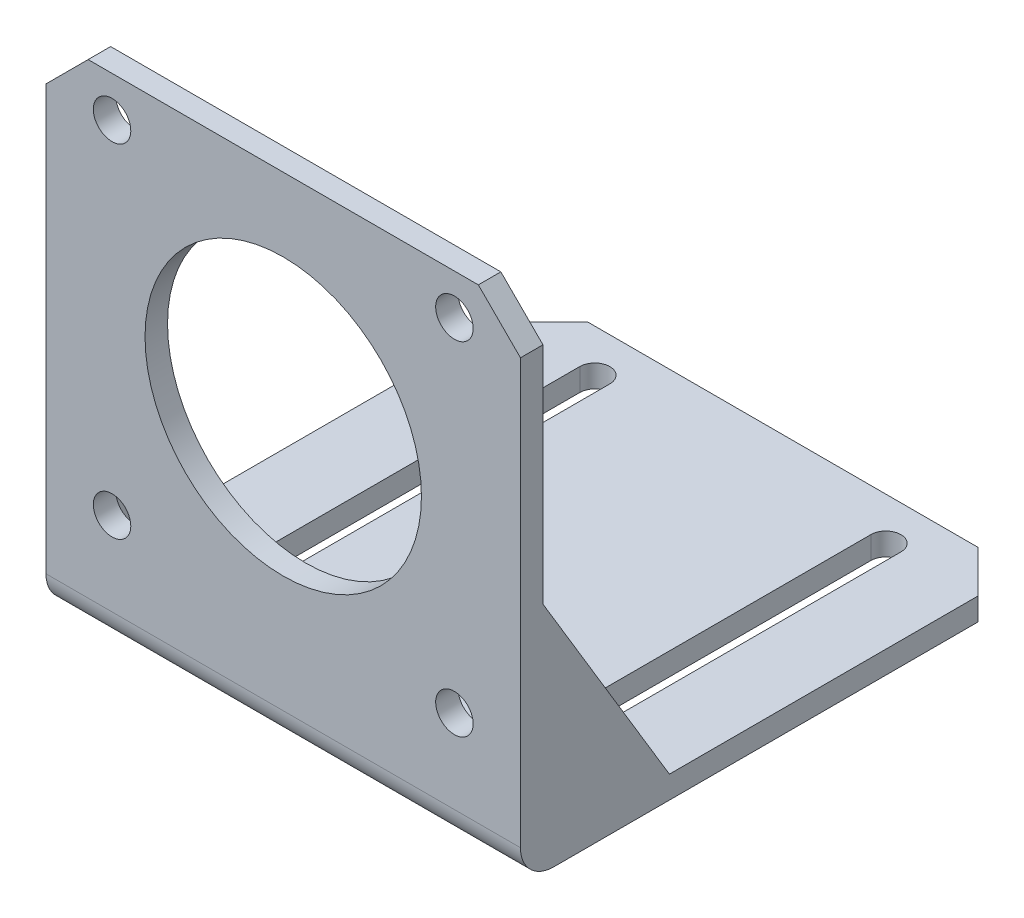
ISO-10303-21;
HEADER;
FILE_DESCRIPTION(('STEP AP214'),'2;1');
FILE_NAME('part.step','',(''),(''),'','','');
FILE_SCHEMA(('AUTOMOTIVE_DESIGN { 1 0 10303 214 1 1 1 1 }'));
ENDSEC;
DATA;
#1=APPLICATION_CONTEXT('core data for automotive mechanical design processes');
#2=APPLICATION_PROTOCOL_DEFINITION('international standard','automotive_design',2000,#1);
#3=PRODUCT_CONTEXT('',#1,'mechanical');
#4=PRODUCT('Part','Part','',(#3));
#5=PRODUCT_RELATED_PRODUCT_CATEGORY('part','',(#4));
#6=PRODUCT_DEFINITION_FORMATION('','',#4);
#7=PRODUCT_DEFINITION_CONTEXT('part definition',#1,'design');
#8=PRODUCT_DEFINITION('design','',#6,#7);
#9=PRODUCT_DEFINITION_SHAPE('','',#8);
#10=(LENGTH_UNIT() NAMED_UNIT(*) SI_UNIT(.MILLI.,.METRE.));
#11=(NAMED_UNIT(*) PLANE_ANGLE_UNIT() SI_UNIT($,.RADIAN.));
#12=(NAMED_UNIT(*) SI_UNIT($,.STERADIAN.) SOLID_ANGLE_UNIT());
#13=UNCERTAINTY_MEASURE_WITH_UNIT(LENGTH_MEASURE(1.E-05),#10,'distance_accuracy_value','');
#14=(GEOMETRIC_REPRESENTATION_CONTEXT(3) GLOBAL_UNCERTAINTY_ASSIGNED_CONTEXT((#13)) GLOBAL_UNIT_ASSIGNED_CONTEXT((#10,
#11,#12)) REPRESENTATION_CONTEXT('',''));
#15=CARTESIAN_POINT('',(0.,0.,0.));
#16=DIRECTION('',(0.,0.,1.));
#17=DIRECTION('',(1.,0.,0.));
#18=AXIS2_PLACEMENT_3D('',#15,#16,#17);
#19=CARTESIAN_POINT('',(65.33,0.,-1.48));
#20=DIRECTION('',(-1.,0.,0.));
#21=DIRECTION('',(0.,0.,1.));
#22=AXIS2_PLACEMENT_3D('',#19,#20,#21);
#23=CYLINDRICAL_SURFACE('',#22,1.48);
#24=DIRECTION('',(-1.,0.,0.));
#25=VECTOR('',#24,1.);
#26=CARTESIAN_POINT('',(65.33,-1.48,-1.47999999999999));
#27=LINE('',#26,#25);
#28=CARTESIAN_POINT('',(62.81,-1.48,-1.48));
#29=VERTEX_POINT('',#28);
#30=CARTESIAN_POINT('',(2.51999999999999,-1.48,-1.47999999999999));
#31=VERTEX_POINT('',#30);
#32=EDGE_CURVE('E327',#29,#31,#27,.T.);
#33=ORIENTED_EDGE('',*,*,#32,.T.);
#34=CARTESIAN_POINT('',(2.51999999999999,0.,-1.48));
#35=DIRECTION('',(1.,0.,0.));
#36=DIRECTION('',(0.,0.,-1.));
#37=AXIS2_PLACEMENT_3D('',#34,#35,#36);
#38=CIRCLE('',#37,1.48);
#39=CARTESIAN_POINT('',(2.51999999999999,0.,0.));
#40=VERTEX_POINT('',#39);
#41=EDGE_CURVE('E291',#31,#40,#38,.F.);
#42=ORIENTED_EDGE('',*,*,#41,.T.);
#43=DIRECTION('',(-1.,0.,0.));
#44=VECTOR('',#43,1.);
#45=CARTESIAN_POINT('',(65.33,0.,0.));
#46=LINE('',#45,#44);
#47=CARTESIAN_POINT('',(62.81,0.,0.));
#48=VERTEX_POINT('',#47);
#49=EDGE_CURVE('E357',#48,#40,#46,.T.);
#50=ORIENTED_EDGE('',*,*,#49,.F.);
#51=CARTESIAN_POINT('',(62.81,0.,-1.48));
#52=DIRECTION('',(1.,0.,0.));
#53=DIRECTION('',(0.,0.,-1.));
#54=AXIS2_PLACEMENT_3D('',#51,#52,#53);
#55=CIRCLE('',#54,1.48);
#56=EDGE_CURVE('E309',#29,#48,#55,.F.);
#57=ORIENTED_EDGE('',*,*,#56,.F.);
#58=EDGE_LOOP('',(#33,#42,#50,#57));
#59=FACE_BOUND('',#58,.T.);
#60=ADVANCED_FACE('F34',(#59),#23,.F.);
#61=CARTESIAN_POINT('',(65.33,0.,0.));
#62=DIRECTION('',(0.,0.,1.));
#63=DIRECTION('',(0.,-1.,0.));
#64=AXIS2_PLACEMENT_3D('',#61,#62,#63);
#65=PLANE('',#64);
#66=CARTESIAN_POINT('',(56.235,11.52,0.));
#67=DIRECTION('',(0.,0.,-1.));
#68=DIRECTION('',(0.,1.,0.));
#69=AXIS2_PLACEMENT_3D('',#66,#67,#68);
#70=CIRCLE('',#69,2.58);
#71=CARTESIAN_POINT('',(56.235,14.1,0.));
#72=VERTEX_POINT('',#71);
#73=EDGE_CURVE('E227',#72,#72,#70,.T.);
#74=ORIENTED_EDGE('',*,*,#73,.F.);
#75=EDGE_LOOP('',(#74));
#76=FACE_BOUND('',#75,.T.);
#77=CARTESIAN_POINT('',(9.095,11.52,0.));
#78=DIRECTION('',(0.,0.,-1.));
#79=DIRECTION('',(0.,1.,0.));
#80=AXIS2_PLACEMENT_3D('',#77,#78,#79);
#81=CIRCLE('',#80,2.58);
#82=CARTESIAN_POINT('',(9.095,14.1,0.));
#83=VERTEX_POINT('',#82);
#84=EDGE_CURVE('E264',#83,#83,#81,.T.);
#85=ORIENTED_EDGE('',*,*,#84,.F.);
#86=EDGE_LOOP('',(#85));
#87=FACE_BOUND('',#86,.T.);
#88=CARTESIAN_POINT('',(56.235,58.66,0.));
#89=DIRECTION('',(0.,0.,-1.));
#90=DIRECTION('',(0.,1.,0.));
#91=AXIS2_PLACEMENT_3D('',#88,#89,#90);
#92=CIRCLE('',#91,2.58);
#93=CARTESIAN_POINT('',(56.235,61.24,0.));
#94=VERTEX_POINT('',#93);
#95=EDGE_CURVE('E258',#94,#94,#92,.T.);
#96=ORIENTED_EDGE('',*,*,#95,.F.);
#97=EDGE_LOOP('',(#96));
#98=FACE_BOUND('',#97,.T.);
#99=CARTESIAN_POINT('',(9.095,58.66,0.));
#100=DIRECTION('',(0.,0.,-1.));
#101=DIRECTION('',(0.,1.,0.));
#102=AXIS2_PLACEMENT_3D('',#99,#100,#101);
#103=CIRCLE('',#102,2.58);
#104=CARTESIAN_POINT('',(9.095,61.24,0.));
#105=VERTEX_POINT('',#104);
#106=EDGE_CURVE('E252',#105,#105,#103,.T.);
#107=ORIENTED_EDGE('',*,*,#106,.F.);
#108=EDGE_LOOP('',(#107));
#109=FACE_BOUND('',#108,.T.);
#110=CARTESIAN_POINT('',(32.665,35.09,0.));
#111=DIRECTION('',(0.,0.,-1.));
#112=DIRECTION('',(0.,1.,0.));
#113=AXIS2_PLACEMENT_3D('',#110,#111,#112);
#114=CIRCLE('',#113,19.03);
#115=CARTESIAN_POINT('',(32.665,54.12,0.));
#116=VERTEX_POINT('',#115);
#117=EDGE_CURVE('E251',#116,#116,#114,.T.);
#118=ORIENTED_EDGE('',*,*,#117,.F.);
#119=EDGE_LOOP('',(#118));
#120=FACE_BOUND('',#119,.T.);
#121=DIRECTION('',(0.,1.,0.));
#122=VECTOR('',#121,1.);
#123=CARTESIAN_POINT('',(2.52,-1.48,0.));
#124=LINE('',#123,#122);
#125=CARTESIAN_POINT('',(2.51999999999999,27.49,0.));
#126=VERTEX_POINT('',#125);
#127=EDGE_CURVE('E278',#40,#126,#124,.T.);
#128=ORIENTED_EDGE('',*,*,#127,.T.);
#129=DIRECTION('',(-1.,0.,0.));
#130=VECTOR('',#129,1.);
#131=CARTESIAN_POINT('',(2.52,27.49,0.));
#132=LINE('',#131,#130);
#133=CARTESIAN_POINT('',(0.,27.49,0.));
#134=VERTEX_POINT('',#133);
#135=EDGE_CURVE('E285',#126,#134,#132,.T.);
#136=ORIENTED_EDGE('',*,*,#135,.T.);
#137=DIRECTION('',(0.,1.,0.));
#138=VECTOR('',#137,1.);
#139=CARTESIAN_POINT('',(0.,0.,0.));
#140=LINE('',#139,#138);
#141=CARTESIAN_POINT('',(0.,58.42,0.));
#142=VERTEX_POINT('',#141);
#143=EDGE_CURVE('E313',#134,#142,#140,.T.);
#144=ORIENTED_EDGE('',*,*,#143,.T.);
#145=DIRECTION('',(-0.707106781186546,-0.707106781186549,0.));
#146=VECTOR('',#145,1.);
#147=CARTESIAN_POINT('',(5.8,64.22,0.));
#148=LINE('',#147,#146);
#149=CARTESIAN_POINT('',(5.8,64.22,0.));
#150=VERTEX_POINT('',#149);
#151=EDGE_CURVE('E377',#142,#150,#148,.F.);
#152=ORIENTED_EDGE('',*,*,#151,.T.);
#153=DIRECTION('',(-1.,0.,0.));
#154=VECTOR('',#153,1.);
#155=CARTESIAN_POINT('',(65.33,64.22,0.));
#156=LINE('',#155,#154);
#157=CARTESIAN_POINT('',(59.53,64.22,0.));
#158=VERTEX_POINT('',#157);
#159=EDGE_CURVE('E354',#158,#150,#156,.T.);
#160=ORIENTED_EDGE('',*,*,#159,.F.);
#161=DIRECTION('',(0.707106781186548,-0.707106781186548,0.));
#162=VECTOR('',#161,1.);
#163=CARTESIAN_POINT('',(65.33,58.42,0.));
#164=LINE('',#163,#162);
#165=CARTESIAN_POINT('',(65.33,58.42,0.));
#166=VERTEX_POINT('',#165);
#167=EDGE_CURVE('E374',#158,#166,#164,.T.);
#168=ORIENTED_EDGE('',*,*,#167,.T.);
#169=DIRECTION('',(0.,1.,0.));
#170=VECTOR('',#169,1.);
#171=CARTESIAN_POINT('',(65.33,0.,0.));
#172=LINE('',#171,#170);
#173=CARTESIAN_POINT('',(65.33,27.49,0.));
#174=VERTEX_POINT('',#173);
#175=EDGE_CURVE('E314',#174,#166,#172,.T.);
#176=ORIENTED_EDGE('',*,*,#175,.F.);
#177=DIRECTION('',(1.,0.,0.));
#178=VECTOR('',#177,1.);
#179=CARTESIAN_POINT('',(62.81,27.49,0.));
#180=LINE('',#179,#178);
#181=CARTESIAN_POINT('',(62.81,27.49,0.));
#182=VERTEX_POINT('',#181);
#183=EDGE_CURVE('E307',#182,#174,#180,.T.);
#184=ORIENTED_EDGE('',*,*,#183,.F.);
#185=DIRECTION('',(0.,-1.,0.));
#186=VECTOR('',#185,1.);
#187=CARTESIAN_POINT('',(62.81,-1.48,0.));
#188=LINE('',#187,#186);
#189=EDGE_CURVE('E295',#182,#48,#188,.T.);
#190=ORIENTED_EDGE('',*,*,#189,.T.);
#191=ORIENTED_EDGE('',*,*,#49,.T.);
#192=EDGE_LOOP('',(#128,#136,#144,#152,#160,#168,#176,#184,#190,#191));
#193=FACE_BOUND('',#192,.T.);
#194=ADVANCED_FACE('F430',(#76,#87,#98,#109,#120,#193),#65,.F.);
#195=CARTESIAN_POINT('',(65.33,64.22,0.));
#196=DIRECTION('',(0.,-1.,0.));
#197=DIRECTION('',(0.,0.,-1.));
#198=AXIS2_PLACEMENT_3D('',#195,#196,#197);
#199=PLANE('',#198);
#200=ORIENTED_EDGE('',*,*,#159,.T.);
#201=DIRECTION('',(0.,0.,1.));
#202=VECTOR('',#201,1.);
#203=CARTESIAN_POINT('',(5.8,64.22,0.));
#204=LINE('',#203,#202);
#205=CARTESIAN_POINT('',(5.8,64.22,3.10000000000001));
#206=VERTEX_POINT('',#205);
#207=EDGE_CURVE('E362',#150,#206,#204,.T.);
#208=ORIENTED_EDGE('',*,*,#207,.T.);
#209=DIRECTION('',(-1.,0.,0.));
#210=VECTOR('',#209,1.);
#211=CARTESIAN_POINT('',(65.33,64.22,3.10000000000001));
#212=LINE('',#211,#210);
#213=CARTESIAN_POINT('',(59.53,64.22,3.10000000000001));
#214=VERTEX_POINT('',#213);
#215=EDGE_CURVE('E351',#214,#206,#212,.T.);
#216=ORIENTED_EDGE('',*,*,#215,.F.);
#217=DIRECTION('',(0.,0.,-1.));
#218=VECTOR('',#217,1.);
#219=CARTESIAN_POINT('',(59.53,64.22,0.));
#220=LINE('',#219,#218);
#221=EDGE_CURVE('E360',#214,#158,#220,.T.);
#222=ORIENTED_EDGE('',*,*,#221,.T.);
#223=EDGE_LOOP('',(#200,#208,#216,#222));
#224=FACE_BOUND('',#223,.T.);
#225=ADVANCED_FACE('F436',(#224),#199,.F.);
#226=CARTESIAN_POINT('',(65.33,0.,3.10000000000001));
#227=DIRECTION('',(0.,0.,-1.));
#228=DIRECTION('',(-1.,0.,0.));
#229=AXIS2_PLACEMENT_3D('',#226,#227,#228);
#230=PLANE('',#229);
#231=CARTESIAN_POINT('',(56.235,11.52,3.10000000000001));
#232=DIRECTION('',(0.,0.,-1.));
#233=DIRECTION('',(0.,1.,0.));
#234=AXIS2_PLACEMENT_3D('',#231,#232,#233);
#235=CIRCLE('',#234,2.58);
#236=CARTESIAN_POINT('',(56.235,14.1,3.10000000000001));
#237=VERTEX_POINT('',#236);
#238=EDGE_CURVE('E267',#237,#237,#235,.T.);
#239=ORIENTED_EDGE('',*,*,#238,.T.);
#240=EDGE_LOOP('',(#239));
#241=FACE_BOUND('',#240,.T.);
#242=CARTESIAN_POINT('',(9.095,11.52,3.10000000000001));
#243=DIRECTION('',(0.,0.,-1.));
#244=DIRECTION('',(0.,1.,0.));
#245=AXIS2_PLACEMENT_3D('',#242,#243,#244);
#246=CIRCLE('',#245,2.58);
#247=CARTESIAN_POINT('',(9.095,14.1,3.10000000000001));
#248=VERTEX_POINT('',#247);
#249=EDGE_CURVE('E261',#248,#248,#246,.T.);
#250=ORIENTED_EDGE('',*,*,#249,.T.);
#251=EDGE_LOOP('',(#250));
#252=FACE_BOUND('',#251,.T.);
#253=CARTESIAN_POINT('',(56.235,58.66,3.10000000000001));
#254=DIRECTION('',(0.,0.,-1.));
#255=DIRECTION('',(0.,1.,0.));
#256=AXIS2_PLACEMENT_3D('',#253,#254,#255);
#257=CIRCLE('',#256,2.58);
#258=CARTESIAN_POINT('',(56.235,61.24,3.10000000000001));
#259=VERTEX_POINT('',#258);
#260=EDGE_CURVE('E255',#259,#259,#257,.T.);
#261=ORIENTED_EDGE('',*,*,#260,.T.);
#262=EDGE_LOOP('',(#261));
#263=FACE_BOUND('',#262,.T.);
#264=CARTESIAN_POINT('',(9.095,58.66,3.10000000000001));
#265=DIRECTION('',(0.,0.,-1.));
#266=DIRECTION('',(0.,1.,0.));
#267=AXIS2_PLACEMENT_3D('',#264,#265,#266);
#268=CIRCLE('',#267,2.58);
#269=CARTESIAN_POINT('',(9.095,61.24,3.10000000000001));
#270=VERTEX_POINT('',#269);
#271=EDGE_CURVE('E248',#270,#270,#268,.T.);
#272=ORIENTED_EDGE('',*,*,#271,.T.);
#273=EDGE_LOOP('',(#272));
#274=FACE_BOUND('',#273,.T.);
#275=CARTESIAN_POINT('',(32.665,35.09,3.10000000000001));
#276=DIRECTION('',(0.,0.,-1.));
#277=DIRECTION('',(0.,1.,0.));
#278=AXIS2_PLACEMENT_3D('',#275,#276,#277);
#279=CIRCLE('',#278,19.03);
#280=CARTESIAN_POINT('',(32.665,54.12,3.10000000000001));
#281=VERTEX_POINT('',#280);
#282=EDGE_CURVE('E272',#281,#281,#279,.T.);
#283=ORIENTED_EDGE('',*,*,#282,.T.);
#284=EDGE_LOOP('',(#283));
#285=FACE_BOUND('',#284,.T.);
#286=ORIENTED_EDGE('',*,*,#215,.T.);
#287=DIRECTION('',(0.707106781186546,0.707106781186549,0.));
#288=VECTOR('',#287,1.);
#289=CARTESIAN_POINT('',(5.8,64.22,3.10000000000001));
#290=LINE('',#289,#288);
#291=CARTESIAN_POINT('',(0.,58.42,3.10000000000001));
#292=VERTEX_POINT('',#291);
#293=EDGE_CURVE('E367',#206,#292,#290,.F.);
#294=ORIENTED_EDGE('',*,*,#293,.T.);
#295=DIRECTION('',(0.,-1.,0.));
#296=VECTOR('',#295,1.);
#297=CARTESIAN_POINT('',(0.,0.,3.10000000000001));
#298=LINE('',#297,#296);
#299=CARTESIAN_POINT('',(0.,0.,3.10000000000001));
#300=VERTEX_POINT('',#299);
#301=EDGE_CURVE('E329',#292,#300,#298,.T.);
#302=ORIENTED_EDGE('',*,*,#301,.T.);
#303=DIRECTION('',(-1.,0.,0.));
#304=VECTOR('',#303,1.);
#305=CARTESIAN_POINT('',(65.33,0.,3.10000000000001));
#306=LINE('',#305,#304);
#307=CARTESIAN_POINT('',(65.33,0.,3.10000000000001));
#308=VERTEX_POINT('',#307);
#309=EDGE_CURVE('E348',#308,#300,#306,.T.);
#310=ORIENTED_EDGE('',*,*,#309,.F.);
#311=DIRECTION('',(0.,-1.,0.));
#312=VECTOR('',#311,1.);
#313=CARTESIAN_POINT('',(65.33,0.,3.10000000000001));
#314=LINE('',#313,#312);
#315=CARTESIAN_POINT('',(65.33,58.42,3.10000000000001));
#316=VERTEX_POINT('',#315);
#317=EDGE_CURVE('E316',#316,#308,#314,.T.);
#318=ORIENTED_EDGE('',*,*,#317,.F.);
#319=DIRECTION('',(-0.707106781186548,0.707106781186548,0.));
#320=VECTOR('',#319,1.);
#321=CARTESIAN_POINT('',(65.33,58.42,3.10000000000001));
#322=LINE('',#321,#320);
#323=EDGE_CURVE('E365',#316,#214,#322,.T.);
#324=ORIENTED_EDGE('',*,*,#323,.T.);
#325=EDGE_LOOP('',(#286,#294,#302,#310,#318,#324));
#326=FACE_BOUND('',#325,.T.);
#327=ADVANCED_FACE('F511',(#241,#252,#263,#274,#285,#326),#230,.F.);
#328=CARTESIAN_POINT('',(65.33,0.,-1.48));
#329=DIRECTION('',(-1.,0.,0.));
#330=DIRECTION('',(0.,0.,1.));
#331=AXIS2_PLACEMENT_3D('',#328,#329,#330);
#332=CYLINDRICAL_SURFACE('',#331,4.58);
#333=CARTESIAN_POINT('',(0.,0.,-1.48));
#334=DIRECTION('',(1.,0.,0.));
#335=DIRECTION('',(0.,0.,-1.));
#336=AXIS2_PLACEMENT_3D('',#333,#334,#335);
#337=CIRCLE('',#336,4.58);
#338=CARTESIAN_POINT('',(0.,-4.58,-1.47999999999999));
#339=VERTEX_POINT('',#338);
#340=EDGE_CURVE('E331',#300,#339,#337,.T.);
#341=ORIENTED_EDGE('',*,*,#340,.T.);
#342=DIRECTION('',(-1.,0.,0.));
#343=VECTOR('',#342,1.);
#344=CARTESIAN_POINT('',(65.33,-4.58,-1.47999999999999));
#345=LINE('',#344,#343);
#346=CARTESIAN_POINT('',(65.33,-4.58,-1.47999999999999));
#347=VERTEX_POINT('',#346);
#348=EDGE_CURVE('E345',#347,#339,#345,.T.);
#349=ORIENTED_EDGE('',*,*,#348,.F.);
#350=CARTESIAN_POINT('',(65.33,0.,-1.48));
#351=DIRECTION('',(1.,0.,0.));
#352=DIRECTION('',(0.,0.,-1.));
#353=AXIS2_PLACEMENT_3D('',#350,#351,#352);
#354=CIRCLE('',#353,4.58);
#355=EDGE_CURVE('E319',#308,#347,#354,.T.);
#356=ORIENTED_EDGE('',*,*,#355,.F.);
#357=ORIENTED_EDGE('',*,*,#309,.T.);
#358=EDGE_LOOP('',(#341,#349,#356,#357));
#359=FACE_BOUND('',#358,.T.);
#360=ADVANCED_FACE('F478',(#359),#332,.T.);
#361=CARTESIAN_POINT('',(65.33,-4.58,-1.47999999999999));
#362=DIRECTION('',(0.,1.,0.));
#363=DIRECTION('',(0.,0.,1.));
#364=AXIS2_PLACEMENT_3D('',#361,#362,#363);
#365=PLANE('',#364);
#366=DIRECTION('',(0.,0.,1.));
#367=VECTOR('',#366,1.);
#368=CARTESIAN_POINT('',(50.635,-4.58,-9.66999999999999));
#369=LINE('',#368,#367);
#370=CARTESIAN_POINT('',(50.635,-4.58,-59.84));
#371=VERTEX_POINT('',#370);
#372=CARTESIAN_POINT('',(50.635,-4.58,-9.66999999999999));
#373=VERTEX_POINT('',#372);
#374=EDGE_CURVE('E207',#371,#373,#369,.T.);
#375=ORIENTED_EDGE('',*,*,#374,.T.);
#376=CARTESIAN_POINT('',(52.705,-4.58,-9.66999999999999));
#377=DIRECTION('',(0.,1.,0.));
#378=DIRECTION('',(0.,0.,1.));
#379=AXIS2_PLACEMENT_3D('',#376,#377,#378);
#380=CIRCLE('',#379,2.07);
#381=CARTESIAN_POINT('',(54.775,-4.58,-9.66999999999999));
#382=VERTEX_POINT('',#381);
#383=EDGE_CURVE('E202',#373,#382,#380,.T.);
#384=ORIENTED_EDGE('',*,*,#383,.T.);
#385=DIRECTION('',(0.,0.,-1.));
#386=VECTOR('',#385,1.);
#387=CARTESIAN_POINT('',(54.775,-4.58,-9.66999999999999));
#388=LINE('',#387,#386);
#389=CARTESIAN_POINT('',(54.775,-4.58,-59.84));
#390=VERTEX_POINT('',#389);
#391=EDGE_CURVE('E210',#382,#390,#388,.T.);
#392=ORIENTED_EDGE('',*,*,#391,.T.);
#393=CARTESIAN_POINT('',(52.705,-4.58,-59.84));
#394=DIRECTION('',(0.,1.,0.));
#395=DIRECTION('',(0.,0.,1.));
#396=AXIS2_PLACEMENT_3D('',#393,#394,#395);
#397=CIRCLE('',#396,2.07);
#398=EDGE_CURVE('E49',#390,#371,#397,.T.);
#399=ORIENTED_EDGE('',*,*,#398,.T.);
#400=EDGE_LOOP('',(#375,#384,#392,#399));
#401=FACE_BOUND('',#400,.T.);
#402=DIRECTION('',(0.,0.,1.));
#403=VECTOR('',#402,1.);
#404=CARTESIAN_POINT('',(10.555,-4.58,-9.66999999999999));
#405=LINE('',#404,#403);
#406=CARTESIAN_POINT('',(10.555,-4.58,-59.84));
#407=VERTEX_POINT('',#406);
#408=CARTESIAN_POINT('',(10.555,-4.58,-9.66999999999999));
#409=VERTEX_POINT('',#408);
#410=EDGE_CURVE('E239',#407,#409,#405,.T.);
#411=ORIENTED_EDGE('',*,*,#410,.T.);
#412=CARTESIAN_POINT('',(12.625,-4.58,-9.66999999999999));
#413=DIRECTION('',(0.,1.,0.));
#414=DIRECTION('',(0.,0.,1.));
#415=AXIS2_PLACEMENT_3D('',#412,#413,#414);
#416=CIRCLE('',#415,2.07);
#417=CARTESIAN_POINT('',(14.695,-4.58,-9.66999999999999));
#418=VERTEX_POINT('',#417);
#419=EDGE_CURVE('E232',#409,#418,#416,.T.);
#420=ORIENTED_EDGE('',*,*,#419,.T.);
#421=DIRECTION('',(0.,0.,-1.));
#422=VECTOR('',#421,1.);
#423=CARTESIAN_POINT('',(14.695,-4.58,-9.66999999999999));
#424=LINE('',#423,#422);
#425=CARTESIAN_POINT('',(14.695,-4.58,-59.84));
#426=VERTEX_POINT('',#425);
#427=EDGE_CURVE('E235',#418,#426,#424,.T.);
#428=ORIENTED_EDGE('',*,*,#427,.T.);
#429=CARTESIAN_POINT('',(12.625,-4.58,-59.84));
#430=DIRECTION('',(0.,1.,0.));
#431=DIRECTION('',(0.,0.,1.));
#432=AXIS2_PLACEMENT_3D('',#429,#430,#431);
#433=CIRCLE('',#432,2.07);
#434=EDGE_CURVE('E57',#426,#407,#433,.T.);
#435=ORIENTED_EDGE('',*,*,#434,.T.);
#436=EDGE_LOOP('',(#411,#420,#428,#435));
#437=FACE_BOUND('',#436,.T.);
#438=DIRECTION('',(0.,0.,-1.));
#439=VECTOR('',#438,1.);
#440=CARTESIAN_POINT('',(0.,-4.58,-1.47999999999999));
#441=LINE('',#440,#439);
#442=CARTESIAN_POINT('',(0.,-4.58,-59.9));
#443=VERTEX_POINT('',#442);
#444=EDGE_CURVE('E333',#339,#443,#441,.T.);
#445=ORIENTED_EDGE('',*,*,#444,.T.);
#446=DIRECTION('',(-0.707106781186546,0.,0.707106781186549));
#447=VECTOR('',#446,1.);
#448=CARTESIAN_POINT('',(5.8,-4.58,-65.7));
#449=LINE('',#448,#447);
#450=CARTESIAN_POINT('',(5.8,-4.58,-65.7));
#451=VERTEX_POINT('',#450);
#452=EDGE_CURVE('E396',#443,#451,#449,.F.);
#453=ORIENTED_EDGE('',*,*,#452,.T.);
#454=DIRECTION('',(-1.,0.,0.));
#455=VECTOR('',#454,1.);
#456=CARTESIAN_POINT('',(65.33,-4.58,-65.7));
#457=LINE('',#456,#455);
#458=CARTESIAN_POINT('',(59.53,-4.58,-65.7));
#459=VERTEX_POINT('',#458);
#460=EDGE_CURVE('E342',#459,#451,#457,.T.);
#461=ORIENTED_EDGE('',*,*,#460,.F.);
#462=DIRECTION('',(0.707106781186548,0.,0.707106781186547));
#463=VECTOR('',#462,1.);
#464=CARTESIAN_POINT('',(65.33,-4.58,-59.9));
#465=LINE('',#464,#463);
#466=CARTESIAN_POINT('',(65.33,-4.58,-59.9));
#467=VERTEX_POINT('',#466);
#468=EDGE_CURVE('E394',#459,#467,#465,.T.);
#469=ORIENTED_EDGE('',*,*,#468,.T.);
#470=DIRECTION('',(0.,0.,-1.));
#471=VECTOR('',#470,1.);
#472=CARTESIAN_POINT('',(65.33,-4.58,-1.47999999999999));
#473=LINE('',#472,#471);
#474=EDGE_CURVE('E321',#347,#467,#473,.T.);
#475=ORIENTED_EDGE('',*,*,#474,.F.);
#476=ORIENTED_EDGE('',*,*,#348,.T.);
#477=EDGE_LOOP('',(#445,#453,#461,#469,#475,#476));
#478=FACE_BOUND('',#477,.T.);
#479=ADVANCED_FACE('F214',(#401,#437,#478),#365,.F.);
#480=CARTESIAN_POINT('',(65.33,-4.58,-65.7));
#481=DIRECTION('',(0.,0.,1.));
#482=DIRECTION('',(1.,0.,0.));
#483=AXIS2_PLACEMENT_3D('',#480,#481,#482);
#484=PLANE('',#483);
#485=ORIENTED_EDGE('',*,*,#460,.T.);
#486=DIRECTION('',(0.,1.,0.));
#487=VECTOR('',#486,1.);
#488=CARTESIAN_POINT('',(5.8,-4.58,-65.7));
#489=LINE('',#488,#487);
#490=CARTESIAN_POINT('',(5.8,-1.48,-65.7));
#491=VERTEX_POINT('',#490);
#492=EDGE_CURVE('E387',#451,#491,#489,.T.);
#493=ORIENTED_EDGE('',*,*,#492,.T.);
#494=DIRECTION('',(-1.,0.,0.));
#495=VECTOR('',#494,1.);
#496=CARTESIAN_POINT('',(65.33,-1.48,-65.7));
#497=LINE('',#496,#495);
#498=CARTESIAN_POINT('',(59.53,-1.48,-65.7));
#499=VERTEX_POINT('',#498);
#500=EDGE_CURVE('E339',#499,#491,#497,.T.);
#501=ORIENTED_EDGE('',*,*,#500,.F.);
#502=DIRECTION('',(0.,-1.,0.));
#503=VECTOR('',#502,1.);
#504=CARTESIAN_POINT('',(59.53,-4.58,-65.7));
#505=LINE('',#504,#503);
#506=EDGE_CURVE('E385',#499,#459,#505,.T.);
#507=ORIENTED_EDGE('',*,*,#506,.T.);
#508=EDGE_LOOP('',(#485,#493,#501,#507));
#509=FACE_BOUND('',#508,.T.);
#510=ADVANCED_FACE('F465',(#509),#484,.F.);
#511=CARTESIAN_POINT('',(65.33,-1.48,-1.47999999999999));
#512=DIRECTION('',(0.,-1.,0.));
#513=DIRECTION('',(0.,0.,-1.));
#514=AXIS2_PLACEMENT_3D('',#511,#512,#513);
#515=PLANE('',#514);
#516=DIRECTION('',(0.,0.,1.));
#517=VECTOR('',#516,1.);
#518=CARTESIAN_POINT('',(54.775,-1.48,-1.47999999999999));
#519=LINE('',#518,#517);
#520=CARTESIAN_POINT('',(54.775,-1.48,-59.84));
#521=VERTEX_POINT('',#520);
#522=CARTESIAN_POINT('',(54.775,-1.48,-9.66999999999999));
#523=VERTEX_POINT('',#522);
#524=EDGE_CURVE('E410',#521,#523,#519,.T.);
#525=ORIENTED_EDGE('',*,*,#524,.T.);
#526=CARTESIAN_POINT('',(52.705,-1.48,-9.66999999999999));
#527=DIRECTION('',(0.,-1.,0.));
#528=DIRECTION('',(0.,0.,-1.));
#529=AXIS2_PLACEMENT_3D('',#526,#527,#528);
#530=CIRCLE('',#529,2.07);
#531=CARTESIAN_POINT('',(50.635,-1.48,-9.66999999999999));
#532=VERTEX_POINT('',#531);
#533=EDGE_CURVE('E11',#523,#532,#530,.T.);
#534=ORIENTED_EDGE('',*,*,#533,.T.);
#535=DIRECTION('',(0.,0.,-1.));
#536=VECTOR('',#535,1.);
#537=CARTESIAN_POINT('',(50.635,-1.48,-1.47999999999999));
#538=LINE('',#537,#536);
#539=CARTESIAN_POINT('',(50.635,-1.48,-59.84));
#540=VERTEX_POINT('',#539);
#541=EDGE_CURVE('E42',#532,#540,#538,.T.);
#542=ORIENTED_EDGE('',*,*,#541,.T.);
#543=CARTESIAN_POINT('',(52.705,-1.48,-59.84));
#544=DIRECTION('',(0.,-1.,0.));
#545=DIRECTION('',(0.,0.,-1.));
#546=AXIS2_PLACEMENT_3D('',#543,#544,#545);
#547=CIRCLE('',#546,2.07);
#548=EDGE_CURVE('E412',#540,#521,#547,.T.);
#549=ORIENTED_EDGE('',*,*,#548,.T.);
#550=EDGE_LOOP('',(#525,#534,#542,#549));
#551=FACE_BOUND('',#550,.T.);
#552=DIRECTION('',(0.,0.,1.));
#553=VECTOR('',#552,1.);
#554=CARTESIAN_POINT('',(14.695,-1.48,-1.47999999999999));
#555=LINE('',#554,#553);
#556=CARTESIAN_POINT('',(14.695,-1.48,-59.84));
#557=VERTEX_POINT('',#556);
#558=CARTESIAN_POINT('',(14.695,-1.48,-9.66999999999999));
#559=VERTEX_POINT('',#558);
#560=EDGE_CURVE('E398',#557,#559,#555,.T.);
#561=ORIENTED_EDGE('',*,*,#560,.T.);
#562=CARTESIAN_POINT('',(12.625,-1.48,-9.66999999999999));
#563=DIRECTION('',(0.,-1.,0.));
#564=DIRECTION('',(0.,0.,-1.));
#565=AXIS2_PLACEMENT_3D('',#562,#563,#564);
#566=CIRCLE('',#565,2.07);
#567=CARTESIAN_POINT('',(10.555,-1.48,-9.66999999999999));
#568=VERTEX_POINT('',#567);
#569=EDGE_CURVE('E407',#559,#568,#566,.T.);
#570=ORIENTED_EDGE('',*,*,#569,.T.);
#571=DIRECTION('',(0.,0.,-1.));
#572=VECTOR('',#571,1.);
#573=CARTESIAN_POINT('',(10.555,-1.48,-1.47999999999999));
#574=LINE('',#573,#572);
#575=CARTESIAN_POINT('',(10.555,-1.48,-59.84));
#576=VERTEX_POINT('',#575);
#577=EDGE_CURVE('E404',#568,#576,#574,.T.);
#578=ORIENTED_EDGE('',*,*,#577,.T.);
#579=CARTESIAN_POINT('',(12.625,-1.48,-59.84));
#580=DIRECTION('',(0.,-1.,0.));
#581=DIRECTION('',(0.,0.,-1.));
#582=AXIS2_PLACEMENT_3D('',#579,#580,#581);
#583=CIRCLE('',#582,2.07);
#584=EDGE_CURVE('E401',#576,#557,#583,.T.);
#585=ORIENTED_EDGE('',*,*,#584,.T.);
#586=EDGE_LOOP('',(#561,#570,#578,#585));
#587=FACE_BOUND('',#586,.T.);
#588=DIRECTION('',(0.,0.,1.));
#589=VECTOR('',#588,1.);
#590=CARTESIAN_POINT('',(0.,-1.48,-1.47999999999999));
#591=LINE('',#590,#589);
#592=CARTESIAN_POINT('',(0.,-1.48,-59.9));
#593=VERTEX_POINT('',#592);
#594=CARTESIAN_POINT('',(0.,-1.48,-17.41));
#595=VERTEX_POINT('',#594);
#596=EDGE_CURVE('E317',#593,#595,#591,.T.);
#597=ORIENTED_EDGE('',*,*,#596,.T.);
#598=DIRECTION('',(-1.,0.,0.));
#599=VECTOR('',#598,1.);
#600=CARTESIAN_POINT('',(2.52,-1.48,-17.41));
#601=LINE('',#600,#599);
#602=CARTESIAN_POINT('',(2.51999999999999,-1.48,-17.41));
#603=VERTEX_POINT('',#602);
#604=EDGE_CURVE('E288',#603,#595,#601,.T.);
#605=ORIENTED_EDGE('',*,*,#604,.F.);
#606=DIRECTION('',(0.,0.,1.));
#607=VECTOR('',#606,1.);
#608=CARTESIAN_POINT('',(2.52,-1.48,-17.41));
#609=LINE('',#608,#607);
#610=EDGE_CURVE('E283',#603,#31,#609,.T.);
#611=ORIENTED_EDGE('',*,*,#610,.T.);
#612=ORIENTED_EDGE('',*,*,#32,.F.);
#613=DIRECTION('',(0.,0.,-1.));
#614=VECTOR('',#613,1.);
#615=CARTESIAN_POINT('',(62.81,-1.48,-17.41));
#616=LINE('',#615,#614);
#617=CARTESIAN_POINT('',(62.81,-1.48,-17.41));
#618=VERTEX_POINT('',#617);
#619=EDGE_CURVE('E298',#29,#618,#616,.T.);
#620=ORIENTED_EDGE('',*,*,#619,.T.);
#621=DIRECTION('',(1.,0.,0.));
#622=VECTOR('',#621,1.);
#623=CARTESIAN_POINT('',(62.81,-1.48,-17.41));
#624=LINE('',#623,#622);
#625=CARTESIAN_POINT('',(65.33,-1.48,-17.41));
#626=VERTEX_POINT('',#625);
#627=EDGE_CURVE('E304',#618,#626,#624,.T.);
#628=ORIENTED_EDGE('',*,*,#627,.T.);
#629=DIRECTION('',(0.,0.,1.));
#630=VECTOR('',#629,1.);
#631=CARTESIAN_POINT('',(65.33,-1.48,-1.47999999999999));
#632=LINE('',#631,#630);
#633=CARTESIAN_POINT('',(65.33,-1.48,-59.9));
#634=VERTEX_POINT('',#633);
#635=EDGE_CURVE('E324',#634,#626,#632,.T.);
#636=ORIENTED_EDGE('',*,*,#635,.F.);
#637=DIRECTION('',(-0.707106781186548,0.,-0.707106781186547));
#638=VECTOR('',#637,1.);
#639=CARTESIAN_POINT('',(65.33,-1.48,-59.9));
#640=LINE('',#639,#638);
#641=EDGE_CURVE('E390',#634,#499,#640,.T.);
#642=ORIENTED_EDGE('',*,*,#641,.T.);
#643=ORIENTED_EDGE('',*,*,#500,.T.);
#644=DIRECTION('',(0.707106781186546,0.,-0.707106781186549));
#645=VECTOR('',#644,1.);
#646=CARTESIAN_POINT('',(5.8,-1.48,-65.7));
#647=LINE('',#646,#645);
#648=EDGE_CURVE('E392',#491,#593,#647,.F.);
#649=ORIENTED_EDGE('',*,*,#648,.T.);
#650=EDGE_LOOP('',(#597,#605,#611,#612,#620,#628,#636,#642,#643,#649));
#651=FACE_BOUND('',#650,.T.);
#652=ADVANCED_FACE('F416',(#551,#587,#651),#515,.F.);
#653=CARTESIAN_POINT('',(65.33,0.,-1.48));
#654=DIRECTION('',(1.,0.,0.));
#655=DIRECTION('',(0.,0.,-1.));
#656=AXIS2_PLACEMENT_3D('',#653,#654,#655);
#657=PLANE('',#656);
#658=DIRECTION('',(0.,0.857127226365768,0.515104763929169));
#659=VECTOR('',#658,1.);
#660=CARTESIAN_POINT('',(65.33,27.49,0.));
#661=LINE('',#660,#659);
#662=EDGE_CURVE('E294',#626,#174,#661,.T.);
#663=ORIENTED_EDGE('',*,*,#662,.T.);
#664=ORIENTED_EDGE('',*,*,#175,.T.);
#665=DIRECTION('',(0.,0.,1.));
#666=VECTOR('',#665,1.);
#667=CARTESIAN_POINT('',(65.33,58.42,3.10000000000001));
#668=LINE('',#667,#666);
#669=EDGE_CURVE('E382',#166,#316,#668,.T.);
#670=ORIENTED_EDGE('',*,*,#669,.T.);
#671=ORIENTED_EDGE('',*,*,#317,.T.);
#672=ORIENTED_EDGE('',*,*,#355,.T.);
#673=ORIENTED_EDGE('',*,*,#474,.T.);
#674=DIRECTION('',(0.,1.,0.));
#675=VECTOR('',#674,1.);
#676=CARTESIAN_POINT('',(65.33,-1.48,-59.9));
#677=LINE('',#676,#675);
#678=EDGE_CURVE('E379',#467,#634,#677,.T.);
#679=ORIENTED_EDGE('',*,*,#678,.T.);
#680=ORIENTED_EDGE('',*,*,#635,.T.);
#681=EDGE_LOOP('',(#663,#664,#670,#671,#672,#673,#679,#680));
#682=FACE_BOUND('',#681,.T.);
#683=ADVANCED_FACE('F471',(#682),#657,.T.);
#684=CARTESIAN_POINT('',(0.,0.,-1.48));
#685=DIRECTION('',(1.,0.,0.));
#686=DIRECTION('',(0.,0.,-1.));
#687=AXIS2_PLACEMENT_3D('',#684,#685,#686);
#688=PLANE('',#687);
#689=ORIENTED_EDGE('',*,*,#143,.F.);
#690=DIRECTION('',(0.,-0.857127226365768,-0.515104763929169));
#691=VECTOR('',#690,1.);
#692=CARTESIAN_POINT('',(0.,27.49,0.));
#693=LINE('',#692,#691);
#694=EDGE_CURVE('E275',#134,#595,#693,.T.);
#695=ORIENTED_EDGE('',*,*,#694,.T.);
#696=ORIENTED_EDGE('',*,*,#596,.F.);
#697=DIRECTION('',(0.,-1.,0.));
#698=VECTOR('',#697,1.);
#699=CARTESIAN_POINT('',(0.,0.,-59.9));
#700=LINE('',#699,#698);
#701=EDGE_CURVE('E369',#593,#443,#700,.T.);
#702=ORIENTED_EDGE('',*,*,#701,.T.);
#703=ORIENTED_EDGE('',*,*,#444,.F.);
#704=ORIENTED_EDGE('',*,*,#340,.F.);
#705=ORIENTED_EDGE('',*,*,#301,.F.);
#706=DIRECTION('',(0.,0.,-1.));
#707=VECTOR('',#706,1.);
#708=CARTESIAN_POINT('',(0.,58.42,-1.48));
#709=LINE('',#708,#707);
#710=EDGE_CURVE('E371',#292,#142,#709,.T.);
#711=ORIENTED_EDGE('',*,*,#710,.T.);
#712=EDGE_LOOP('',(#689,#695,#696,#702,#703,#704,#705,#711));
#713=FACE_BOUND('',#712,.T.);
#714=ADVANCED_FACE('F445',(#713),#688,.F.);
#715=CARTESIAN_POINT('',(5.8,64.22,0.));
#716=DIRECTION('',(0.707106781186549,-0.707106781186546,0.));
#717=DIRECTION('',(0.,0.,1.));
#718=AXIS2_PLACEMENT_3D('',#715,#716,#717);
#719=PLANE('',#718);
#720=ORIENTED_EDGE('',*,*,#151,.F.);
#721=ORIENTED_EDGE('',*,*,#710,.F.);
#722=ORIENTED_EDGE('',*,*,#293,.F.);
#723=ORIENTED_EDGE('',*,*,#207,.F.);
#724=EDGE_LOOP('',(#720,#721,#722,#723));
#725=FACE_BOUND('',#724,.T.);
#726=ADVANCED_FACE('F441',(#725),#719,.F.);
#727=CARTESIAN_POINT('',(65.33,58.42,-1.48));
#728=DIRECTION('',(0.707106781186547,0.707106781186547,0.));
#729=DIRECTION('',(0.,0.,-1.));
#730=AXIS2_PLACEMENT_3D('',#727,#728,#729);
#731=PLANE('',#730);
#732=ORIENTED_EDGE('',*,*,#167,.F.);
#733=ORIENTED_EDGE('',*,*,#221,.F.);
#734=ORIENTED_EDGE('',*,*,#323,.F.);
#735=ORIENTED_EDGE('',*,*,#669,.F.);
#736=EDGE_LOOP('',(#732,#733,#734,#735));
#737=FACE_BOUND('',#736,.T.);
#738=ADVANCED_FACE('F444',(#737),#731,.T.);
#739=CARTESIAN_POINT('',(5.8,-4.58,-65.7));
#740=DIRECTION('',(0.707106781186549,0.,0.707106781186546));
#741=DIRECTION('',(0.,1.,0.));
#742=AXIS2_PLACEMENT_3D('',#739,#740,#741);
#743=PLANE('',#742);
#744=ORIENTED_EDGE('',*,*,#452,.F.);
#745=ORIENTED_EDGE('',*,*,#701,.F.);
#746=ORIENTED_EDGE('',*,*,#648,.F.);
#747=ORIENTED_EDGE('',*,*,#492,.F.);
#748=EDGE_LOOP('',(#744,#745,#746,#747));
#749=FACE_BOUND('',#748,.T.);
#750=ADVANCED_FACE('F448',(#749),#743,.F.);
#751=CARTESIAN_POINT('',(65.33,0.,-59.9));
#752=DIRECTION('',(0.707106781186547,0.,-0.707106781186548));
#753=DIRECTION('',(0.,-1.,0.));
#754=AXIS2_PLACEMENT_3D('',#751,#752,#753);
#755=PLANE('',#754);
#756=ORIENTED_EDGE('',*,*,#468,.F.);
#757=ORIENTED_EDGE('',*,*,#506,.F.);
#758=ORIENTED_EDGE('',*,*,#641,.F.);
#759=ORIENTED_EDGE('',*,*,#678,.F.);
#760=EDGE_LOOP('',(#756,#757,#758,#759));
#761=FACE_BOUND('',#760,.T.);
#762=ADVANCED_FACE('F36',(#761),#755,.T.);
#763=CARTESIAN_POINT('',(62.81,0.,0.));
#764=DIRECTION('',(1.,0.,0.));
#765=DIRECTION('',(0.,0.,-1.));
#766=AXIS2_PLACEMENT_3D('',#763,#764,#765);
#767=PLANE('',#766);
#768=ORIENTED_EDGE('',*,*,#619,.F.);
#769=ORIENTED_EDGE('',*,*,#56,.T.);
#770=ORIENTED_EDGE('',*,*,#189,.F.);
#771=DIRECTION('',(0.,0.857127226365768,0.515104763929169));
#772=VECTOR('',#771,1.);
#773=CARTESIAN_POINT('',(62.81,27.49,0.));
#774=LINE('',#773,#772);
#775=EDGE_CURVE('E301',#618,#182,#774,.T.);
#776=ORIENTED_EDGE('',*,*,#775,.F.);
#777=EDGE_LOOP('',(#768,#769,#770,#776));
#778=FACE_BOUND('',#777,.T.);
#779=ADVANCED_FACE('F455',(#778),#767,.F.);
#780=CARTESIAN_POINT('',(62.81,27.49,0.));
#781=DIRECTION('',(0.,0.515104763929169,-0.857127226365768));
#782=DIRECTION('',(0.,0.857127226365768,0.515104763929169));
#783=AXIS2_PLACEMENT_3D('',#780,#781,#782);
#784=PLANE('',#783);
#785=ORIENTED_EDGE('',*,*,#662,.F.);
#786=ORIENTED_EDGE('',*,*,#627,.F.);
#787=ORIENTED_EDGE('',*,*,#775,.T.);
#788=ORIENTED_EDGE('',*,*,#183,.T.);
#789=EDGE_LOOP('',(#785,#786,#787,#788));
#790=FACE_BOUND('',#789,.T.);
#791=ADVANCED_FACE('F504',(#790),#784,.T.);
#792=CARTESIAN_POINT('',(2.52,0.,0.));
#793=DIRECTION('',(1.,0.,0.));
#794=DIRECTION('',(0.,0.,-1.));
#795=AXIS2_PLACEMENT_3D('',#792,#793,#794);
#796=PLANE('',#795);
#797=ORIENTED_EDGE('',*,*,#41,.F.);
#798=ORIENTED_EDGE('',*,*,#610,.F.);
#799=DIRECTION('',(0.,-0.857127226365768,-0.515104763929169));
#800=VECTOR('',#799,1.);
#801=CARTESIAN_POINT('',(2.52,27.49,0.));
#802=LINE('',#801,#800);
#803=EDGE_CURVE('E280',#126,#603,#802,.T.);
#804=ORIENTED_EDGE('',*,*,#803,.F.);
#805=ORIENTED_EDGE('',*,*,#127,.F.);
#806=EDGE_LOOP('',(#797,#798,#804,#805));
#807=FACE_BOUND('',#806,.T.);
#808=ADVANCED_FACE('F494',(#807),#796,.T.);
#809=CARTESIAN_POINT('',(2.52,27.49,0.));
#810=DIRECTION('',(0.,0.515104763929169,-0.857127226365768));
#811=DIRECTION('',(0.,0.857127226365768,0.515104763929169));
#812=AXIS2_PLACEMENT_3D('',#809,#810,#811);
#813=PLANE('',#812);
#814=ORIENTED_EDGE('',*,*,#694,.F.);
#815=ORIENTED_EDGE('',*,*,#135,.F.);
#816=ORIENTED_EDGE('',*,*,#803,.T.);
#817=ORIENTED_EDGE('',*,*,#604,.T.);
#818=EDGE_LOOP('',(#814,#815,#816,#817));
#819=FACE_BOUND('',#818,.T.);
#820=ADVANCED_FACE('F487',(#819),#813,.T.);
#821=CARTESIAN_POINT('',(32.665,35.09,3.10000000000001));
#822=DIRECTION('',(0.,0.,-1.));
#823=DIRECTION('',(0.,1.,0.));
#824=AXIS2_PLACEMENT_3D('',#821,#822,#823);
#825=CYLINDRICAL_SURFACE('',#824,19.03);
#826=ORIENTED_EDGE('',*,*,#282,.F.);
#827=EDGE_LOOP('',(#826));
#828=FACE_BOUND('',#827,.T.);
#829=ORIENTED_EDGE('',*,*,#117,.T.);
#830=EDGE_LOOP('',(#829));
#831=FACE_BOUND('',#830,.T.);
#832=ADVANCED_FACE('F541',(#828,#831),#825,.F.);
#833=CARTESIAN_POINT('',(9.095,58.66,3.10000000000001));
#834=DIRECTION('',(0.,0.,-1.));
#835=DIRECTION('',(0.,1.,0.));
#836=AXIS2_PLACEMENT_3D('',#833,#834,#835);
#837=CYLINDRICAL_SURFACE('',#836,2.58);
#838=ORIENTED_EDGE('',*,*,#271,.F.);
#839=EDGE_LOOP('',(#838));
#840=FACE_BOUND('',#839,.T.);
#841=ORIENTED_EDGE('',*,*,#106,.T.);
#842=EDGE_LOOP('',(#841));
#843=FACE_BOUND('',#842,.T.);
#844=ADVANCED_FACE('F546',(#840,#843),#837,.F.);
#845=CARTESIAN_POINT('',(56.235,58.66,3.10000000000001));
#846=DIRECTION('',(0.,0.,-1.));
#847=DIRECTION('',(0.,1.,0.));
#848=AXIS2_PLACEMENT_3D('',#845,#846,#847);
#849=CYLINDRICAL_SURFACE('',#848,2.58);
#850=ORIENTED_EDGE('',*,*,#260,.F.);
#851=EDGE_LOOP('',(#850));
#852=FACE_BOUND('',#851,.T.);
#853=ORIENTED_EDGE('',*,*,#95,.T.);
#854=EDGE_LOOP('',(#853));
#855=FACE_BOUND('',#854,.T.);
#856=ADVANCED_FACE('F556',(#852,#855),#849,.F.);
#857=CARTESIAN_POINT('',(9.095,11.52,3.10000000000001));
#858=DIRECTION('',(0.,0.,-1.));
#859=DIRECTION('',(0.,1.,0.));
#860=AXIS2_PLACEMENT_3D('',#857,#858,#859);
#861=CYLINDRICAL_SURFACE('',#860,2.58);
#862=ORIENTED_EDGE('',*,*,#249,.F.);
#863=EDGE_LOOP('',(#862));
#864=FACE_BOUND('',#863,.T.);
#865=ORIENTED_EDGE('',*,*,#84,.T.);
#866=EDGE_LOOP('',(#865));
#867=FACE_BOUND('',#866,.T.);
#868=ADVANCED_FACE('F552',(#864,#867),#861,.F.);
#869=CARTESIAN_POINT('',(56.235,11.52,3.10000000000001));
#870=DIRECTION('',(0.,0.,-1.));
#871=DIRECTION('',(0.,1.,0.));
#872=AXIS2_PLACEMENT_3D('',#869,#870,#871);
#873=CYLINDRICAL_SURFACE('',#872,2.58);
#874=ORIENTED_EDGE('',*,*,#238,.F.);
#875=EDGE_LOOP('',(#874));
#876=FACE_BOUND('',#875,.T.);
#877=ORIENTED_EDGE('',*,*,#73,.T.);
#878=EDGE_LOOP('',(#877));
#879=FACE_BOUND('',#878,.T.);
#880=ADVANCED_FACE('F548',(#876,#879),#873,.F.);
#881=CARTESIAN_POINT('',(12.625,-4.58,-9.66999999999999));
#882=DIRECTION('',(0.,1.,0.));
#883=DIRECTION('',(0.,0.,1.));
#884=AXIS2_PLACEMENT_3D('',#881,#882,#883);
#885=CYLINDRICAL_SURFACE('',#884,2.07);
#886=DIRECTION('',(0.,1.,0.));
#887=VECTOR('',#886,1.);
#888=CARTESIAN_POINT('',(14.695,-4.58,-9.66999999999999));
#889=LINE('',#888,#887);
#890=EDGE_CURVE('E241',#418,#559,#889,.T.);
#891=ORIENTED_EDGE('',*,*,#890,.F.);
#892=ORIENTED_EDGE('',*,*,#419,.F.);
#893=DIRECTION('',(0.,1.,0.));
#894=VECTOR('',#893,1.);
#895=CARTESIAN_POINT('',(10.555,-4.58,-9.66999999999999));
#896=LINE('',#895,#894);
#897=EDGE_CURVE('E217',#409,#568,#896,.T.);
#898=ORIENTED_EDGE('',*,*,#897,.T.);
#899=ORIENTED_EDGE('',*,*,#569,.F.);
#900=EDGE_LOOP('',(#891,#892,#898,#899));
#901=FACE_BOUND('',#900,.T.);
#902=ADVANCED_FACE('F551',(#901),#885,.F.);
#903=CARTESIAN_POINT('',(10.555,-4.58,-9.66999999999999));
#904=DIRECTION('',(-1.,0.,0.));
#905=DIRECTION('',(0.,0.,1.));
#906=AXIS2_PLACEMENT_3D('',#903,#904,#905);
#907=PLANE('',#906);
#908=ORIENTED_EDGE('',*,*,#897,.F.);
#909=ORIENTED_EDGE('',*,*,#410,.F.);
#910=DIRECTION('',(0.,1.,0.));
#911=VECTOR('',#910,1.);
#912=CARTESIAN_POINT('',(10.555,-4.58,-59.84));
#913=LINE('',#912,#911);
#914=EDGE_CURVE('E220',#407,#576,#913,.T.);
#915=ORIENTED_EDGE('',*,*,#914,.T.);
#916=ORIENTED_EDGE('',*,*,#577,.F.);
#917=EDGE_LOOP('',(#908,#909,#915,#916));
#918=FACE_BOUND('',#917,.T.);
#919=ADVANCED_FACE('F566',(#918),#907,.F.);
#920=CARTESIAN_POINT('',(12.625,-4.58,-59.84));
#921=DIRECTION('',(0.,1.,0.));
#922=DIRECTION('',(0.,0.,1.));
#923=AXIS2_PLACEMENT_3D('',#920,#921,#922);
#924=CYLINDRICAL_SURFACE('',#923,2.07);
#925=ORIENTED_EDGE('',*,*,#914,.F.);
#926=ORIENTED_EDGE('',*,*,#434,.F.);
#927=DIRECTION('',(0.,1.,0.));
#928=VECTOR('',#927,1.);
#929=CARTESIAN_POINT('',(14.695,-4.58,-59.84));
#930=LINE('',#929,#928);
#931=EDGE_CURVE('E245',#426,#557,#930,.T.);
#932=ORIENTED_EDGE('',*,*,#931,.T.);
#933=ORIENTED_EDGE('',*,*,#584,.F.);
#934=EDGE_LOOP('',(#925,#926,#932,#933));
#935=FACE_BOUND('',#934,.T.);
#936=ADVANCED_FACE('F571',(#935),#924,.F.);
#937=CARTESIAN_POINT('',(14.695,-4.58,-9.66999999999999));
#938=DIRECTION('',(1.,0.,0.));
#939=DIRECTION('',(0.,0.,-1.));
#940=AXIS2_PLACEMENT_3D('',#937,#938,#939);
#941=PLANE('',#940);
#942=ORIENTED_EDGE('',*,*,#931,.F.);
#943=ORIENTED_EDGE('',*,*,#427,.F.);
#944=ORIENTED_EDGE('',*,*,#890,.T.);
#945=ORIENTED_EDGE('',*,*,#560,.F.);
#946=EDGE_LOOP('',(#942,#943,#944,#945));
#947=FACE_BOUND('',#946,.T.);
#948=ADVANCED_FACE('F568',(#947),#941,.F.);
#949=CARTESIAN_POINT('',(52.705,-4.58,-9.66999999999999));
#950=DIRECTION('',(0.,1.,0.));
#951=DIRECTION('',(0.,0.,1.));
#952=AXIS2_PLACEMENT_3D('',#949,#950,#951);
#953=CYLINDRICAL_SURFACE('',#952,2.07);
#954=DIRECTION('',(0.,1.,0.));
#955=VECTOR('',#954,1.);
#956=CARTESIAN_POINT('',(54.775,-4.58,-9.66999999999999));
#957=LINE('',#956,#955);
#958=EDGE_CURVE('E197',#382,#523,#957,.T.);
#959=ORIENTED_EDGE('',*,*,#958,.F.);
#960=ORIENTED_EDGE('',*,*,#383,.F.);
#961=DIRECTION('',(0.,1.,0.));
#962=VECTOR('',#961,1.);
#963=CARTESIAN_POINT('',(50.635,-4.58,-9.66999999999999));
#964=LINE('',#963,#962);
#965=EDGE_CURVE('E225',#373,#532,#964,.T.);
#966=ORIENTED_EDGE('',*,*,#965,.T.);
#967=ORIENTED_EDGE('',*,*,#533,.F.);
#968=EDGE_LOOP('',(#959,#960,#966,#967));
#969=FACE_BOUND('',#968,.T.);
#970=ADVANCED_FACE('F199',(#969),#953,.F.);
#971=CARTESIAN_POINT('',(50.635,-4.58,-9.66999999999999));
#972=DIRECTION('',(-1.,0.,0.));
#973=DIRECTION('',(0.,0.,1.));
#974=AXIS2_PLACEMENT_3D('',#971,#972,#973);
#975=PLANE('',#974);
#976=ORIENTED_EDGE('',*,*,#965,.F.);
#977=ORIENTED_EDGE('',*,*,#374,.F.);
#978=DIRECTION('',(0.,1.,0.));
#979=VECTOR('',#978,1.);
#980=CARTESIAN_POINT('',(50.635,-4.58,-59.84));
#981=LINE('',#980,#979);
#982=EDGE_CURVE('E228',#371,#540,#981,.T.);
#983=ORIENTED_EDGE('',*,*,#982,.T.);
#984=ORIENTED_EDGE('',*,*,#541,.F.);
#985=EDGE_LOOP('',(#976,#977,#983,#984));
#986=FACE_BOUND('',#985,.T.);
#987=ADVANCED_FACE('F419',(#986),#975,.F.);
#988=CARTESIAN_POINT('',(52.705,-4.58,-59.84));
#989=DIRECTION('',(0.,1.,0.));
#990=DIRECTION('',(0.,0.,1.));
#991=AXIS2_PLACEMENT_3D('',#988,#989,#990);
#992=CYLINDRICAL_SURFACE('',#991,2.07);
#993=ORIENTED_EDGE('',*,*,#982,.F.);
#994=ORIENTED_EDGE('',*,*,#398,.F.);
#995=DIRECTION('',(0.,1.,0.));
#996=VECTOR('',#995,1.);
#997=CARTESIAN_POINT('',(54.775,-4.58,-59.84));
#998=LINE('',#997,#996);
#999=EDGE_CURVE('E206',#390,#521,#998,.T.);
#1000=ORIENTED_EDGE('',*,*,#999,.T.);
#1001=ORIENTED_EDGE('',*,*,#548,.F.);
#1002=EDGE_LOOP('',(#993,#994,#1000,#1001));
#1003=FACE_BOUND('',#1002,.T.);
#1004=ADVANCED_FACE('F420',(#1003),#992,.F.);
#1005=CARTESIAN_POINT('',(54.775,-4.58,-9.66999999999999));
#1006=DIRECTION('',(1.,0.,0.));
#1007=DIRECTION('',(0.,0.,-1.));
#1008=AXIS2_PLACEMENT_3D('',#1005,#1006,#1007);
#1009=PLANE('',#1008);
#1010=ORIENTED_EDGE('',*,*,#999,.F.);
#1011=ORIENTED_EDGE('',*,*,#391,.F.);
#1012=ORIENTED_EDGE('',*,*,#958,.T.);
#1013=ORIENTED_EDGE('',*,*,#524,.F.);
#1014=EDGE_LOOP('',(#1010,#1011,#1012,#1013));
#1015=FACE_BOUND('',#1014,.T.);
#1016=ADVANCED_FACE('F211',(#1015),#1009,.F.);
#1017=CLOSED_SHELL('',(#60,#194,#225,#327,#360,#479,#510,#652,#683,#714,#726,#738,#750,#762,
#779,#791,#808,#820,#832,#844,#856,#868,#880,#902,#919,#936,#948,#970,#987,#1004,#1016));
#1018=MANIFOLD_SOLID_BREP('B2',#1017);
#1019=ADVANCED_BREP_SHAPE_REPRESENTATION('',(#18,#1018),#14);
#1020=SHAPE_DEFINITION_REPRESENTATION(#9,#1019);
ENDSEC;
END-ISO-10303-21;
